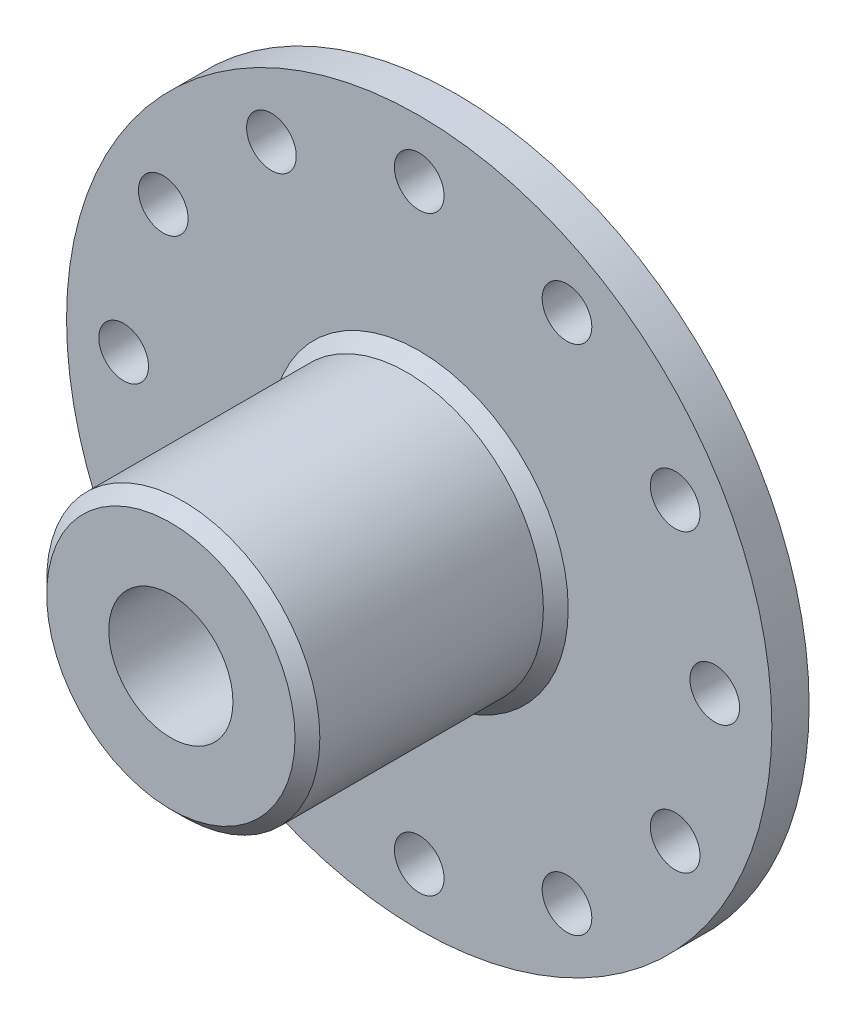
ISO-10303-21;
HEADER;
FILE_DESCRIPTION(('STEP AP214'),'2;1');
FILE_NAME('part.step','',(''),(''),'','','');
FILE_SCHEMA(('AUTOMOTIVE_DESIGN { 1 0 10303 214 1 1 1 1 }'));
ENDSEC;
DATA;
#1=APPLICATION_CONTEXT('core data for automotive mechanical design processes');
#2=APPLICATION_PROTOCOL_DEFINITION('international standard','automotive_design',2000,#1);
#3=PRODUCT_CONTEXT('',#1,'mechanical');
#4=PRODUCT('Part','Part','',(#3));
#5=PRODUCT_RELATED_PRODUCT_CATEGORY('part','',(#4));
#6=PRODUCT_DEFINITION_FORMATION('','',#4);
#7=PRODUCT_DEFINITION_CONTEXT('part definition',#1,'design');
#8=PRODUCT_DEFINITION('design','',#6,#7);
#9=PRODUCT_DEFINITION_SHAPE('','',#8);
#10=(LENGTH_UNIT() NAMED_UNIT(*) SI_UNIT(.MILLI.,.METRE.));
#11=(NAMED_UNIT(*) PLANE_ANGLE_UNIT() SI_UNIT($,.RADIAN.));
#12=(NAMED_UNIT(*) SI_UNIT($,.STERADIAN.) SOLID_ANGLE_UNIT());
#13=UNCERTAINTY_MEASURE_WITH_UNIT(LENGTH_MEASURE(1.E-05),#10,'distance_accuracy_value','');
#14=(GEOMETRIC_REPRESENTATION_CONTEXT(3) GLOBAL_UNCERTAINTY_ASSIGNED_CONTEXT((#13)) GLOBAL_UNIT_ASSIGNED_CONTEXT((#10,
#11,#12)) REPRESENTATION_CONTEXT('',''));
#15=CARTESIAN_POINT('',(0.,0.,0.));
#16=DIRECTION('',(0.,0.,1.));
#17=DIRECTION('',(1.,0.,0.));
#18=AXIS2_PLACEMENT_3D('',#15,#16,#17);
#19=CARTESIAN_POINT('',(0.,0.,3.));
#20=DIRECTION('',(0.,0.,-1.));
#21=DIRECTION('',(-1.,0.,0.));
#22=AXIS2_PLACEMENT_3D('',#19,#20,#21);
#23=CYLINDRICAL_SURFACE('',#22,28.4);
#24=CARTESIAN_POINT('',(0.,0.,3.));
#25=DIRECTION('',(0.,0.,1.));
#26=DIRECTION('',(1.,0.,0.));
#27=AXIS2_PLACEMENT_3D('',#24,#25,#26);
#28=CIRCLE('',#27,28.4);
#29=CARTESIAN_POINT('',(28.4,0.,3.));
#30=VERTEX_POINT('',#29);
#31=EDGE_CURVE('E54',#30,#30,#28,.T.);
#32=ORIENTED_EDGE('',*,*,#31,.F.);
#33=EDGE_LOOP('',(#32));
#34=FACE_BOUND('',#33,.T.);
#35=CARTESIAN_POINT('',(0.,0.,0.));
#36=DIRECTION('',(0.,0.,1.));
#37=DIRECTION('',(1.,0.,0.));
#38=AXIS2_PLACEMENT_3D('',#35,#36,#37);
#39=CIRCLE('',#38,28.4);
#40=CARTESIAN_POINT('',(28.4,0.,0.));
#41=VERTEX_POINT('',#40);
#42=EDGE_CURVE('E65',#41,#41,#39,.T.);
#43=ORIENTED_EDGE('',*,*,#42,.T.);
#44=EDGE_LOOP('',(#43));
#45=FACE_BOUND('',#44,.T.);
#46=ADVANCED_FACE('F34',(#34,#45),#23,.T.);
#47=CARTESIAN_POINT('',(0.,0.,3.));
#48=DIRECTION('',(0.,0.,1.));
#49=DIRECTION('',(1.,0.,0.));
#50=AXIS2_PLACEMENT_3D('',#47,#48,#49);
#51=PLANE('',#50);
#52=CARTESIAN_POINT('',(-11.8999999999999,20.6114046100697,3.));
#53=DIRECTION('',(0.,0.,1.));
#54=DIRECTION('',(0.499999999999998,0.86602540378444,0.));
#55=AXIS2_PLACEMENT_3D('',#52,#53,#54);
#56=CIRCLE('',#55,2.00000000000002);
#57=CARTESIAN_POINT('',(-10.8999999999999,22.3434554176386,3.));
#58=VERTEX_POINT('',#57);
#59=EDGE_CURVE('E202',#58,#58,#56,.T.);
#60=ORIENTED_EDGE('',*,*,#59,.F.);
#61=EDGE_LOOP('',(#60));
#62=FACE_BOUND('',#61,.T.);
#63=CARTESIAN_POINT('',(-20.6114046100696,11.9000000000001,3.));
#64=DIRECTION('',(0.,0.,1.));
#65=DIRECTION('',(0.,1.,0.));
#66=AXIS2_PLACEMENT_3D('',#63,#64,#65);
#67=CIRCLE('',#66,2.00000000000002);
#68=CARTESIAN_POINT('',(-20.6114046100696,13.9000000000001,3.));
#69=VERTEX_POINT('',#68);
#70=EDGE_CURVE('E196',#69,#69,#67,.T.);
#71=ORIENTED_EDGE('',*,*,#70,.F.);
#72=EDGE_LOOP('',(#71));
#73=FACE_BOUND('',#72,.T.);
#74=CARTESIAN_POINT('',(-23.8,0.,3.));
#75=DIRECTION('',(0.,0.,1.));
#76=DIRECTION('',(-0.500000000000004,0.866025403784436,0.));
#77=AXIS2_PLACEMENT_3D('',#74,#75,#76);
#78=CIRCLE('',#77,2.00000000000002);
#79=CARTESIAN_POINT('',(-24.8,1.73205080756898,3.));
#80=VERTEX_POINT('',#79);
#81=EDGE_CURVE('E190',#80,#80,#78,.T.);
#82=ORIENTED_EDGE('',*,*,#81,.F.);
#83=EDGE_LOOP('',(#82));
#84=FACE_BOUND('',#83,.T.);
#85=CARTESIAN_POINT('',(-20.6114046100697,-11.8999999999999,3.));
#86=DIRECTION('',(0.,0.,1.));
#87=DIRECTION('',(-0.866025403784442,0.499999999999995,0.));
#88=AXIS2_PLACEMENT_3D('',#85,#86,#87);
#89=CIRCLE('',#88,2.00000000000002);
#90=CARTESIAN_POINT('',(-22.3434554176386,-10.8999999999999,3.));
#91=VERTEX_POINT('',#90);
#92=EDGE_CURVE('E184',#91,#91,#89,.T.);
#93=ORIENTED_EDGE('',*,*,#92,.F.);
#94=EDGE_LOOP('',(#93));
#95=FACE_BOUND('',#94,.T.);
#96=CARTESIAN_POINT('',(-11.9000000000002,-20.6114046100695,3.));
#97=DIRECTION('',(0.,0.,1.));
#98=DIRECTION('',(-1.,0.,0.));
#99=AXIS2_PLACEMENT_3D('',#96,#97,#98);
#100=CIRCLE('',#99,2.00000000000002);
#101=CARTESIAN_POINT('',(-13.9000000000002,-20.6114046100695,3.));
#102=VERTEX_POINT('',#101);
#103=EDGE_CURVE('E178',#102,#102,#100,.T.);
#104=ORIENTED_EDGE('',*,*,#103,.F.);
#105=EDGE_LOOP('',(#104));
#106=FACE_BOUND('',#105,.T.);
#107=CARTESIAN_POINT('',(0.,-23.8,3.));
#108=DIRECTION('',(0.,0.,1.));
#109=DIRECTION('',(-0.866025403784435,-0.500000000000007,0.));
#110=AXIS2_PLACEMENT_3D('',#107,#108,#109);
#111=CIRCLE('',#110,2.00000000000002);
#112=CARTESIAN_POINT('',(-1.73205080756889,-24.8,3.));
#113=VERTEX_POINT('',#112);
#114=EDGE_CURVE('E172',#113,#113,#111,.T.);
#115=ORIENTED_EDGE('',*,*,#114,.F.);
#116=EDGE_LOOP('',(#115));
#117=FACE_BOUND('',#116,.T.);
#118=CARTESIAN_POINT('',(11.9,-20.6114046100696,3.));
#119=DIRECTION('',(0.,0.,1.));
#120=DIRECTION('',(-0.499999999999992,-0.866025403784443,0.));
#121=AXIS2_PLACEMENT_3D('',#118,#119,#120);
#122=CIRCLE('',#121,2.00000000000002);
#123=CARTESIAN_POINT('',(10.9,-22.3434554176385,3.));
#124=VERTEX_POINT('',#123);
#125=EDGE_CURVE('E166',#124,#124,#122,.T.);
#126=ORIENTED_EDGE('',*,*,#125,.F.);
#127=EDGE_LOOP('',(#126));
#128=FACE_BOUND('',#127,.T.);
#129=CARTESIAN_POINT('',(20.6114046100697,-11.9,3.));
#130=DIRECTION('',(0.,0.,1.));
#131=DIRECTION('',(0.,-1.,0.));
#132=AXIS2_PLACEMENT_3D('',#129,#130,#131);
#133=CIRCLE('',#132,2.00000000000002);
#134=CARTESIAN_POINT('',(20.6114046100697,-13.9,3.));
#135=VERTEX_POINT('',#134);
#136=EDGE_CURVE('E160',#135,#135,#133,.T.);
#137=ORIENTED_EDGE('',*,*,#136,.F.);
#138=EDGE_LOOP('',(#137));
#139=FACE_BOUND('',#138,.T.);
#140=CARTESIAN_POINT('',(23.8,0.,3.));
#141=DIRECTION('',(0.,0.,1.));
#142=DIRECTION('',(0.50000000000001,-0.866025403784433,0.));
#143=AXIS2_PLACEMENT_3D('',#140,#141,#142);
#144=CIRCLE('',#143,2.00000000000002);
#145=CARTESIAN_POINT('',(24.8,-1.7320508075688,3.));
#146=VERTEX_POINT('',#145);
#147=EDGE_CURVE('E154',#146,#146,#144,.T.);
#148=ORIENTED_EDGE('',*,*,#147,.F.);
#149=EDGE_LOOP('',(#148));
#150=FACE_BOUND('',#149,.T.);
#151=CARTESIAN_POINT('',(20.6114046100696,11.9000000000001,3.));
#152=DIRECTION('',(0.,0.,1.));
#153=DIRECTION('',(0.866025403784445,-0.499999999999989,0.));
#154=AXIS2_PLACEMENT_3D('',#151,#152,#153);
#155=CIRCLE('',#154,2.00000000000002);
#156=CARTESIAN_POINT('',(22.3434554176385,10.9000000000001,3.));
#157=VERTEX_POINT('',#156);
#158=EDGE_CURVE('E148',#157,#157,#155,.T.);
#159=ORIENTED_EDGE('',*,*,#158,.F.);
#160=EDGE_LOOP('',(#159));
#161=FACE_BOUND('',#160,.T.);
#162=CARTESIAN_POINT('',(1.73472347597681E-13,23.8,3.));
#163=DIRECTION('',(0.,0.,1.));
#164=DIRECTION('',(0.866025403784438,0.500000000000001,0.));
#165=AXIS2_PLACEMENT_3D('',#162,#163,#164);
#166=CIRCLE('',#165,2.00000000000002);
#167=CARTESIAN_POINT('',(1.73205080756906,24.8,3.));
#168=VERTEX_POINT('',#167);
#169=EDGE_CURVE('E140',#168,#168,#166,.T.);
#170=ORIENTED_EDGE('',*,*,#169,.F.);
#171=EDGE_LOOP('',(#170));
#172=FACE_BOUND('',#171,.T.);
#173=CARTESIAN_POINT('',(11.9000000000002,20.6114046100695,3.));
#174=DIRECTION('',(0.,0.,1.));
#175=DIRECTION('',(1.,0.,0.));
#176=AXIS2_PLACEMENT_3D('',#173,#174,#175);
#177=CIRCLE('',#176,2.00000000000002);
#178=CARTESIAN_POINT('',(13.9000000000002,20.6114046100695,3.));
#179=VERTEX_POINT('',#178);
#180=EDGE_CURVE('E88',#179,#179,#177,.T.);
#181=ORIENTED_EDGE('',*,*,#180,.F.);
#182=EDGE_LOOP('',(#181));
#183=FACE_BOUND('',#182,.T.);
#184=CARTESIAN_POINT('',(0.,0.,3.));
#185=DIRECTION('',(0.,0.,1.));
#186=DIRECTION('',(1.,0.,0.));
#187=AXIS2_PLACEMENT_3D('',#184,#185,#186);
#188=CIRCLE('',#187,12.);
#189=CARTESIAN_POINT('',(12.,0.,3.));
#190=VERTEX_POINT('',#189);
#191=EDGE_CURVE('E41',#190,#190,#188,.F.);
#192=ORIENTED_EDGE('',*,*,#191,.T.);
#193=EDGE_LOOP('',(#192));
#194=FACE_BOUND('',#193,.T.);
#195=ORIENTED_EDGE('',*,*,#31,.T.);
#196=EDGE_LOOP('',(#195));
#197=FACE_BOUND('',#196,.T.);
#198=ADVANCED_FACE('F99',(#62,#73,#84,#95,#106,#117,#128,#139,#150,#161,#172,#183,#194,#197),
#51,.T.);
#199=CARTESIAN_POINT('',(0.,0.,0.));
#200=DIRECTION('',(0.,0.,1.));
#201=DIRECTION('',(1.,0.,0.));
#202=AXIS2_PLACEMENT_3D('',#199,#200,#201);
#203=PLANE('',#202);
#204=CARTESIAN_POINT('',(-11.8999999999999,20.6114046100697,0.));
#205=DIRECTION('',(0.,0.,1.));
#206=DIRECTION('',(0.499999999999998,0.86602540378444,0.));
#207=AXIS2_PLACEMENT_3D('',#204,#205,#206);
#208=CIRCLE('',#207,2.00000000000002);
#209=CARTESIAN_POINT('',(-10.8999999999999,22.3434554176386,0.));
#210=VERTEX_POINT('',#209);
#211=EDGE_CURVE('E145',#210,#210,#208,.T.);
#212=ORIENTED_EDGE('',*,*,#211,.T.);
#213=EDGE_LOOP('',(#212));
#214=FACE_BOUND('',#213,.T.);
#215=CARTESIAN_POINT('',(-20.6114046100696,11.9000000000001,0.));
#216=DIRECTION('',(0.,0.,1.));
#217=DIRECTION('',(0.,1.,0.));
#218=AXIS2_PLACEMENT_3D('',#215,#216,#217);
#219=CIRCLE('',#218,2.00000000000002);
#220=CARTESIAN_POINT('',(-20.6114046100696,13.9000000000001,0.));
#221=VERTEX_POINT('',#220);
#222=EDGE_CURVE('E199',#221,#221,#219,.T.);
#223=ORIENTED_EDGE('',*,*,#222,.T.);
#224=EDGE_LOOP('',(#223));
#225=FACE_BOUND('',#224,.T.);
#226=CARTESIAN_POINT('',(-23.8,0.,0.));
#227=DIRECTION('',(0.,0.,1.));
#228=DIRECTION('',(-0.500000000000004,0.866025403784436,0.));
#229=AXIS2_PLACEMENT_3D('',#226,#227,#228);
#230=CIRCLE('',#229,2.00000000000002);
#231=CARTESIAN_POINT('',(-24.8,1.73205080756898,0.));
#232=VERTEX_POINT('',#231);
#233=EDGE_CURVE('E193',#232,#232,#230,.T.);
#234=ORIENTED_EDGE('',*,*,#233,.T.);
#235=EDGE_LOOP('',(#234));
#236=FACE_BOUND('',#235,.T.);
#237=CARTESIAN_POINT('',(-20.6114046100697,-11.8999999999999,0.));
#238=DIRECTION('',(0.,0.,1.));
#239=DIRECTION('',(-0.866025403784442,0.499999999999995,0.));
#240=AXIS2_PLACEMENT_3D('',#237,#238,#239);
#241=CIRCLE('',#240,2.00000000000002);
#242=CARTESIAN_POINT('',(-22.3434554176386,-10.8999999999999,0.));
#243=VERTEX_POINT('',#242);
#244=EDGE_CURVE('E187',#243,#243,#241,.T.);
#245=ORIENTED_EDGE('',*,*,#244,.T.);
#246=EDGE_LOOP('',(#245));
#247=FACE_BOUND('',#246,.T.);
#248=CARTESIAN_POINT('',(-11.9000000000002,-20.6114046100695,0.));
#249=DIRECTION('',(0.,0.,1.));
#250=DIRECTION('',(-1.,0.,0.));
#251=AXIS2_PLACEMENT_3D('',#248,#249,#250);
#252=CIRCLE('',#251,2.00000000000002);
#253=CARTESIAN_POINT('',(-13.9000000000002,-20.6114046100695,0.));
#254=VERTEX_POINT('',#253);
#255=EDGE_CURVE('E181',#254,#254,#252,.T.);
#256=ORIENTED_EDGE('',*,*,#255,.T.);
#257=EDGE_LOOP('',(#256));
#258=FACE_BOUND('',#257,.T.);
#259=CARTESIAN_POINT('',(0.,-23.8,0.));
#260=DIRECTION('',(0.,0.,1.));
#261=DIRECTION('',(-0.866025403784435,-0.500000000000007,0.));
#262=AXIS2_PLACEMENT_3D('',#259,#260,#261);
#263=CIRCLE('',#262,2.00000000000002);
#264=CARTESIAN_POINT('',(-1.73205080756889,-24.8,0.));
#265=VERTEX_POINT('',#264);
#266=EDGE_CURVE('E175',#265,#265,#263,.T.);
#267=ORIENTED_EDGE('',*,*,#266,.T.);
#268=EDGE_LOOP('',(#267));
#269=FACE_BOUND('',#268,.T.);
#270=CARTESIAN_POINT('',(11.9,-20.6114046100696,0.));
#271=DIRECTION('',(0.,0.,1.));
#272=DIRECTION('',(-0.499999999999992,-0.866025403784443,0.));
#273=AXIS2_PLACEMENT_3D('',#270,#271,#272);
#274=CIRCLE('',#273,2.00000000000002);
#275=CARTESIAN_POINT('',(10.9,-22.3434554176385,0.));
#276=VERTEX_POINT('',#275);
#277=EDGE_CURVE('E169',#276,#276,#274,.T.);
#278=ORIENTED_EDGE('',*,*,#277,.T.);
#279=EDGE_LOOP('',(#278));
#280=FACE_BOUND('',#279,.T.);
#281=CARTESIAN_POINT('',(20.6114046100697,-11.9,0.));
#282=DIRECTION('',(0.,0.,1.));
#283=DIRECTION('',(0.,-1.,0.));
#284=AXIS2_PLACEMENT_3D('',#281,#282,#283);
#285=CIRCLE('',#284,2.00000000000002);
#286=CARTESIAN_POINT('',(20.6114046100697,-13.9,0.));
#287=VERTEX_POINT('',#286);
#288=EDGE_CURVE('E163',#287,#287,#285,.T.);
#289=ORIENTED_EDGE('',*,*,#288,.T.);
#290=EDGE_LOOP('',(#289));
#291=FACE_BOUND('',#290,.T.);
#292=CARTESIAN_POINT('',(23.8,0.,0.));
#293=DIRECTION('',(0.,0.,1.));
#294=DIRECTION('',(0.50000000000001,-0.866025403784433,0.));
#295=AXIS2_PLACEMENT_3D('',#292,#293,#294);
#296=CIRCLE('',#295,2.00000000000002);
#297=CARTESIAN_POINT('',(24.8,-1.7320508075688,0.));
#298=VERTEX_POINT('',#297);
#299=EDGE_CURVE('E157',#298,#298,#296,.T.);
#300=ORIENTED_EDGE('',*,*,#299,.T.);
#301=EDGE_LOOP('',(#300));
#302=FACE_BOUND('',#301,.T.);
#303=CARTESIAN_POINT('',(20.6114046100696,11.9000000000001,0.));
#304=DIRECTION('',(0.,0.,1.));
#305=DIRECTION('',(0.866025403784445,-0.499999999999989,0.));
#306=AXIS2_PLACEMENT_3D('',#303,#304,#305);
#307=CIRCLE('',#306,2.00000000000002);
#308=CARTESIAN_POINT('',(22.3434554176385,10.9000000000001,0.));
#309=VERTEX_POINT('',#308);
#310=EDGE_CURVE('E151',#309,#309,#307,.T.);
#311=ORIENTED_EDGE('',*,*,#310,.T.);
#312=EDGE_LOOP('',(#311));
#313=FACE_BOUND('',#312,.T.);
#314=CARTESIAN_POINT('',(1.73472347597681E-13,23.8,0.));
#315=DIRECTION('',(0.,0.,1.));
#316=DIRECTION('',(0.866025403784438,0.500000000000001,0.));
#317=AXIS2_PLACEMENT_3D('',#314,#315,#316);
#318=CIRCLE('',#317,2.00000000000002);
#319=CARTESIAN_POINT('',(1.73205080756906,24.8,0.));
#320=VERTEX_POINT('',#319);
#321=EDGE_CURVE('E138',#320,#320,#318,.T.);
#322=ORIENTED_EDGE('',*,*,#321,.T.);
#323=EDGE_LOOP('',(#322));
#324=FACE_BOUND('',#323,.T.);
#325=CARTESIAN_POINT('',(11.9000000000002,20.6114046100695,0.));
#326=DIRECTION('',(0.,0.,1.));
#327=DIRECTION('',(1.,0.,0.));
#328=AXIS2_PLACEMENT_3D('',#325,#326,#327);
#329=CIRCLE('',#328,2.00000000000002);
#330=CARTESIAN_POINT('',(13.9000000000002,20.6114046100695,0.));
#331=VERTEX_POINT('',#330);
#332=EDGE_CURVE('E64',#331,#331,#329,.T.);
#333=ORIENTED_EDGE('',*,*,#332,.T.);
#334=EDGE_LOOP('',(#333));
#335=FACE_BOUND('',#334,.T.);
#336=CARTESIAN_POINT('',(0.,0.,0.));
#337=DIRECTION('',(0.,0.,1.));
#338=DIRECTION('',(1.,0.,0.));
#339=AXIS2_PLACEMENT_3D('',#336,#337,#338);
#340=CIRCLE('',#339,5.);
#341=CARTESIAN_POINT('',(5.,0.,0.));
#342=VERTEX_POINT('',#341);
#343=EDGE_CURVE('E90',#342,#342,#340,.T.);
#344=ORIENTED_EDGE('',*,*,#343,.T.);
#345=EDGE_LOOP('',(#344));
#346=FACE_BOUND('',#345,.T.);
#347=ORIENTED_EDGE('',*,*,#42,.F.);
#348=EDGE_LOOP('',(#347));
#349=FACE_BOUND('',#348,.T.);
#350=ADVANCED_FACE('F97',(#214,#225,#236,#247,#258,#269,#280,#291,#302,#313,#324,#335,#346,
#349),#203,.F.);
#351=CARTESIAN_POINT('',(0.,0.,23.));
#352=DIRECTION('',(0.,0.,-1.));
#353=DIRECTION('',(-1.,0.,0.));
#354=AXIS2_PLACEMENT_3D('',#351,#352,#353);
#355=CYLINDRICAL_SURFACE('',#354,11.);
#356=CARTESIAN_POINT('',(0.,0.,4.00000000000001));
#357=DIRECTION('',(0.,0.,1.));
#358=DIRECTION('',(1.,0.,0.));
#359=AXIS2_PLACEMENT_3D('',#356,#357,#358);
#360=CIRCLE('',#359,11.);
#361=CARTESIAN_POINT('',(11.,0.,4.00000000000001));
#362=VERTEX_POINT('',#361);
#363=EDGE_CURVE('E45',#362,#362,#360,.T.);
#364=ORIENTED_EDGE('',*,*,#363,.T.);
#365=EDGE_LOOP('',(#364));
#366=FACE_BOUND('',#365,.T.);
#367=CARTESIAN_POINT('',(0.,0.,22.));
#368=DIRECTION('',(0.,0.,1.));
#369=DIRECTION('',(1.,0.,0.));
#370=AXIS2_PLACEMENT_3D('',#367,#368,#369);
#371=CIRCLE('',#370,11.);
#372=CARTESIAN_POINT('',(11.,0.,22.));
#373=VERTEX_POINT('',#372);
#374=EDGE_CURVE('E49',#373,#373,#371,.F.);
#375=ORIENTED_EDGE('',*,*,#374,.T.);
#376=EDGE_LOOP('',(#375));
#377=FACE_BOUND('',#376,.T.);
#378=CARTESIAN_POINT('',(0.,-11.,17.));
#379=CARTESIAN_POINT('',(0.111357271644373,-10.9999980072786,16.9999956813393));
#380=CARTESIAN_POINT('',(0.222771449918202,-10.9982915273343,16.9906682425174));
#381=CARTESIAN_POINT('',(0.442464406848309,-10.99164847502,16.9536265339751));
#382=CARTESIAN_POINT('',(0.550740387266074,-10.9867091072254,16.9258963514186));
#383=CARTESIAN_POINT('',(0.760947572513749,-10.9741532323507,16.852922870329));
#384=CARTESIAN_POINT('',(0.862884263930179,-10.9665390793192,16.8076949678102));
#385=CARTESIAN_POINT('',(1.0577120033845,-10.949466714983,16.7010526688082));
#386=CARTESIAN_POINT('',(1.15060386767905,-10.9400086703132,16.6396397348118));
#387=CARTESIAN_POINT('',(1.32576444051239,-10.9201743349983,16.5016340903573));
#388=CARTESIAN_POINT('',(1.40791622603346,-10.9097897259708,16.4248941580192));
#389=CARTESIAN_POINT('',(1.55825357341079,-10.8893349521181,16.2587296459102));
#390=CARTESIAN_POINT('',(1.62643816794977,-10.8792648091126,16.1693041883108));
#391=CARTESIAN_POINT('',(1.74738695016477,-10.8604984020977,15.9794872705402));
#392=CARTESIAN_POINT('',(1.80003313265556,-10.851812871101,15.8790194647696));
#393=CARTESIAN_POINT('',(1.88765546949978,-10.836915832769,15.670481349676));
#394=CARTESIAN_POINT('',(1.92263305283275,-10.8307041253674,15.562411655975));
#395=CARTESIAN_POINT('',(1.97355197711315,-10.8215415351671,15.3429853506434));
#396=CARTESIAN_POINT('',(1.98969666425445,-10.8185558462234,15.2316774082904));
#397=CARTESIAN_POINT('',(2.00312248736688,-10.8160783143231,15.0078955926854));
#398=CARTESIAN_POINT('',(2.00040521296643,-10.8165861769405,14.895421818484));
#399=CARTESIAN_POINT('',(1.97634934427,-10.8210066504918,14.673968085867));
#400=CARTESIAN_POINT('',(1.95524117699072,-10.8248771281426,14.5649621321043));
#401=CARTESIAN_POINT('',(1.89536523340026,-10.8355206127391,14.3520649816328));
#402=CARTESIAN_POINT('',(1.85659674743188,-10.8422937363232,14.2481739906482));
#403=CARTESIAN_POINT('',(1.76227297789295,-10.8580238155272,14.0477772092213));
#404=CARTESIAN_POINT('',(1.7066239037154,-10.8669929171435,13.9513165573339));
#405=CARTESIAN_POINT('',(1.58018503374043,-10.8860962201172,13.7690152630547));
#406=CARTESIAN_POINT('',(1.50939379023584,-10.8962305328347,13.6831756373538));
#407=CARTESIAN_POINT('',(1.35343399418352,-10.9167064080854,13.5232210035556));
#408=CARTESIAN_POINT('',(1.2680681726569,-10.9270488181647,13.4492983115631));
#409=CARTESIAN_POINT('',(1.08604454069331,-10.9466375043709,13.3167948665192));
#410=CARTESIAN_POINT('',(0.989386629498157,-10.9558837707156,13.2582142503787));
#411=CARTESIAN_POINT('',(0.787327598497296,-10.9722553782534,13.158032610215));
#412=CARTESIAN_POINT('',(0.681916780395491,-10.9793783255922,13.116450731304));
#413=CARTESIAN_POINT('',(0.465448414462665,-10.9906820547088,13.0516368075063));
#414=CARTESIAN_POINT('',(0.354391431316063,-10.994863130091,13.0284029314261));
#415=CARTESIAN_POINT('',(0.131438649578498,-10.9997719337866,13.0012102380809));
#416=CARTESIAN_POINT('',(0.019576012108933,-11.0005468934114,12.9969877765459));
#417=CARTESIAN_POINT('',(-0.203257238970968,-10.998686302475,13.0072317981815));
#418=CARTESIAN_POINT('',(-0.314227893453083,-10.9960509090871,13.0216974200717));
#419=CARTESIAN_POINT('',(-0.531297097592759,-10.9876950863245,13.0686877495619));
#420=CARTESIAN_POINT('',(-0.637425297458318,-10.9819973157216,13.1010798691828));
#421=CARTESIAN_POINT('',(-0.842744713756611,-10.9681529512222,13.1828608285219));
#422=CARTESIAN_POINT('',(-0.94193548096095,-10.9600061989244,13.2322507676977));
#423=CARTESIAN_POINT('',(-1.13169524707494,-10.9420497958484,13.3472146378029));
#424=CARTESIAN_POINT('',(-1.22216445208488,-10.932223816146,13.4129506871559));
#425=CARTESIAN_POINT('',(-1.39088213822347,-10.9120428807109,13.5585203766711));
#426=CARTESIAN_POINT('',(-1.46912954974332,-10.901687878785,13.6383552494119));
#427=CARTESIAN_POINT('',(-1.6121773788768,-10.8814603955764,13.8110468814485));
#428=CARTESIAN_POINT('',(-1.67679836741418,-10.8715955212189,13.9040533065259));
#429=CARTESIAN_POINT('',(-1.78949986552014,-10.8536151008102,14.0997561814065));
#430=CARTESIAN_POINT('',(-1.83758096630795,-10.8454994922354,14.2024522846844));
#431=CARTESIAN_POINT('',(-1.91557945241746,-10.8319954461548,14.4141507496917));
#432=CARTESIAN_POINT('',(-1.9455810786184,-10.8265943801675,14.5231212307381));
#433=CARTESIAN_POINT('',(-1.98683040178554,-10.8191012654539,14.7446629886311));
#434=CARTESIAN_POINT('',(-1.99808007453629,-10.8170088681136,14.8572338848489));
#435=CARTESIAN_POINT('',(-2.00144313663184,-10.8163869388262,15.0809853754636));
#436=CARTESIAN_POINT('',(-1.99383937001232,-10.8178047454411,15.1921616714385));
#437=CARTESIAN_POINT('',(-1.96032846912815,-10.8239270874703,15.4116236380174));
#438=CARTESIAN_POINT('',(-1.93442142905718,-10.8286316059701,15.5199093234943));
#439=CARTESIAN_POINT('',(-1.86515567158476,-10.8407757208091,15.7303761973954));
#440=CARTESIAN_POINT('',(-1.82182581019232,-10.8482107929975,15.8325671602234));
#441=CARTESIAN_POINT('',(-1.71897473664823,-10.8649817751485,16.0282744471647));
#442=CARTESIAN_POINT('',(-1.65945247569007,-10.8743178082294,16.1217902088456));
#443=CARTESIAN_POINT('',(-1.52491543662799,-10.8940032465147,16.2989128745956));
#444=CARTESIAN_POINT('',(-1.44969415553099,-10.9043650783111,16.3823615698708));
#445=CARTESIAN_POINT('',(-1.28632651423364,-10.9248399206865,16.5355470810122));
#446=CARTESIAN_POINT('',(-1.19817718680093,-10.9349528735191,16.6052807403922));
#447=CARTESIAN_POINT('',(-1.0105711896463,-10.9538897429719,16.7296002971235));
#448=CARTESIAN_POINT('',(-0.911025849790496,-10.9627021317343,16.7840541851801));
#449=CARTESIAN_POINT('',(-0.704073905086345,-10.9779326099335,16.8753792160741));
#450=CARTESIAN_POINT('',(-0.596674925486671,-10.9843529858473,16.9122671592783));
#451=CARTESIAN_POINT('',(-0.407441749458407,-10.9927407037649,16.9597754303022));
#452=CARTESIAN_POINT('',(-0.326725427276491,-10.9954478027358,16.9748343329604));
#453=CARTESIAN_POINT('',(-0.164016342132203,-10.9990781643304,16.9949480937949));
#454=CARTESIAN_POINT('',(-0.0820236084408332,-11.0000014678,17.0000031810418));
#455=CARTESIAN_POINT('',(0.,-11.,17.));
#456=B_SPLINE_CURVE_WITH_KNOTS('',3,(#378,#379,#380,#381,#382,#383,#384,#385,#386,#387,#388,
#389,#390,#391,#392,#393,#394,#395,#396,#397,#398,#399,#400,#401,#402,#403,#404,#405,#406,#407,
#408,#409,#410,#411,#412,#413,#414,#415,#416,#417,#418,#419,#420,#421,#422,#423,#424,#425,#426,
#427,#428,#429,#430,#431,#432,#433,#434,#435,#436,#437,#438,#439,#440,#441,#442,#443,#444,#445,
#446,#447,#448,#449,#450,#451,#452,#453,#454,#455),.UNSPECIFIED.,.T.,.F.,(4,2,2,2,2,2,2,2,2,2,2,
2,2,2,2,2,2,2,2,2,2,2,2,2,2,2,2,2,2,2,2,2,2,2,2,2,2,2,4),(0.,0.333771891552332,
0.667832772072591,1.00160038286675,1.3353378446015,1.67245014596885,2.00958578663079,
2.3492195220365,2.6888257845573,3.02473021172645,3.36060633024203,3.69233367290895,
4.02407434678871,4.35769306461625,4.69134369321255,5.02993210441872,5.36852353704646,
5.70749527023812,6.04643316861453,6.38065600997364,6.71486344850797,7.0466314328543,
7.37842088074221,7.71364226795666,8.04889297616123,8.38831506130458,8.72772501252474,
9.06554101076157,9.40332141303601,9.73606509730371,10.0688070691931,10.4010002025896,
10.733214857769,11.0701111453004,11.4070848782946,11.7468860454293,12.0863615649817,
12.3322171022956,12.5780670098676),.UNSPECIFIED.);
#457=CARTESIAN_POINT('',(0.,-11.,17.));
#458=VERTEX_POINT('',#457);
#459=EDGE_CURVE('E63',#458,#458,#456,.T.);
#460=ORIENTED_EDGE('',*,*,#459,.T.);
#461=EDGE_LOOP('',(#460));
#462=FACE_BOUND('',#461,.T.);
#463=ADVANCED_FACE('F92',(#366,#377,#462),#355,.T.);
#464=CARTESIAN_POINT('',(0.,0.,23.));
#465=DIRECTION('',(0.,0.,1.));
#466=DIRECTION('',(1.,0.,0.));
#467=AXIS2_PLACEMENT_3D('',#464,#465,#466);
#468=PLANE('',#467);
#469=CARTESIAN_POINT('',(0.,0.,23.));
#470=DIRECTION('',(0.,0.,1.));
#471=DIRECTION('',(1.,0.,0.));
#472=AXIS2_PLACEMENT_3D('',#469,#470,#471);
#473=CIRCLE('',#472,10.);
#474=CARTESIAN_POINT('',(10.,0.,23.));
#475=VERTEX_POINT('',#474);
#476=EDGE_CURVE('E10',#475,#475,#473,.T.);
#477=ORIENTED_EDGE('',*,*,#476,.T.);
#478=EDGE_LOOP('',(#477));
#479=FACE_BOUND('',#478,.T.);
#480=CARTESIAN_POINT('',(0.,0.,23.));
#481=DIRECTION('',(0.,0.,1.));
#482=DIRECTION('',(1.,0.,0.));
#483=AXIS2_PLACEMENT_3D('',#480,#481,#482);
#484=CIRCLE('',#483,5.);
#485=CARTESIAN_POINT('',(5.,0.,23.));
#486=VERTEX_POINT('',#485);
#487=EDGE_CURVE('E87',#486,#486,#484,.T.);
#488=ORIENTED_EDGE('',*,*,#487,.F.);
#489=EDGE_LOOP('',(#488));
#490=FACE_BOUND('',#489,.T.);
#491=ADVANCED_FACE('F96',(#479,#490),#468,.T.);
#492=CARTESIAN_POINT('',(0.,0.,0.));
#493=DIRECTION('',(0.,0.,1.));
#494=DIRECTION('',(1.,0.,0.));
#495=AXIS2_PLACEMENT_3D('',#492,#493,#494);
#496=CYLINDRICAL_SURFACE('',#495,5.);
#497=CARTESIAN_POINT('',(0.,-5.,17.));
#498=CARTESIAN_POINT('',(-0.107493005442891,-4.99999271227085,16.9999901481763));
#499=CARTESIAN_POINT('',(-0.215172564090673,-4.99649294306932,16.9912822479116));
#500=CARTESIAN_POINT('',(-0.427496480417896,-4.98283453100641,16.9567522964788));
#501=CARTESIAN_POINT('',(-0.532131777561248,-4.97265778698877,16.9308837209139));
#502=CARTESIAN_POINT('',(-0.734953922727403,-4.94674209213118,16.8631239219412));
#503=CARTESIAN_POINT('',(-0.83316066161696,-4.93102136364072,16.8212851537833));
#504=CARTESIAN_POINT('',(-1.02107197032837,-4.89556610796078,16.7229808266735));
#505=CARTESIAN_POINT('',(-1.11077947675099,-4.87583297458057,16.6665203450811));
#506=CARTESIAN_POINT('',(-1.28350100757039,-4.83330886170419,16.5377645014391));
#507=CARTESIAN_POINT('',(-1.36606227255021,-4.81042296929191,16.4648933437597));
#508=CARTESIAN_POINT('',(-1.51817500478472,-4.76460576906195,16.3065999965232));
#509=CARTESIAN_POINT('',(-1.58772010713353,-4.74167444453792,16.2211717027883));
#510=CARTESIAN_POINT('',(-1.71487456729288,-4.69722791797136,16.0355719297577));
#511=CARTESIAN_POINT('',(-1.77181498119547,-4.67582115964951,15.9349135139768));
#512=CARTESIAN_POINT('',(-1.86775471903715,-4.63833647186793,15.72446360158));
#513=CARTESIAN_POINT('',(-1.90676256428583,-4.62225601244176,15.6146764721516));
#514=CARTESIAN_POINT('',(-1.96389882339587,-4.59826357660818,15.3942876664079));
#515=CARTESIAN_POINT('',(-1.98289396580565,-4.59001420355605,15.2839487644238));
#516=CARTESIAN_POINT('',(-2.00217296164003,-4.58164004049144,15.0613650016927));
#517=CARTESIAN_POINT('',(-2.00246601631322,-4.58151125522768,14.949121105375));
#518=CARTESIAN_POINT('',(-1.98498936750454,-4.58910500279994,14.734243328542));
#519=CARTESIAN_POINT('',(-1.96847531430514,-4.5962817503845,14.631484285591));
#520=CARTESIAN_POINT('',(-1.91994688029782,-4.61676187607836,14.4303404439933));
#521=CARTESIAN_POINT('',(-1.88792979480463,-4.63006632321673,14.3319564118897));
#522=CARTESIAN_POINT('',(-1.80869473255107,-4.6615948508853,14.139982163804));
#523=CARTESIAN_POINT('',(-1.76117986231532,-4.67991379280788,14.0465307609453));
#524=CARTESIAN_POINT('',(-1.65250646073221,-4.7193811638989,13.8685841836384));
#525=CARTESIAN_POINT('',(-1.59134280510084,-4.74053065456848,13.7840923905972));
#526=CARTESIAN_POINT('',(-1.45155059945443,-4.78526736742271,13.619590271198));
#527=CARTESIAN_POINT('',(-1.37193746297063,-4.80891664976152,13.540431270554));
#528=CARTESIAN_POINT('',(-1.20031442743019,-4.85459824958282,13.396315521998));
#529=CARTESIAN_POINT('',(-1.10830206533443,-4.87663024445325,13.3313616025897));
#530=CARTESIAN_POINT('',(-0.912077652605843,-4.91714681264548,13.2163825525842));
#531=CARTESIAN_POINT('',(-0.807660491346477,-4.93555270095415,13.1666777188029));
#532=CARTESIAN_POINT('',(-0.591023765482881,-4.96614828328759,13.0858321389219));
#533=CARTESIAN_POINT('',(-0.478808196849673,-4.97834113462382,13.0546819624426));
#534=CARTESIAN_POINT('',(-0.25689588760782,-4.99456139506911,13.0135517045803));
#535=CARTESIAN_POINT('',(-0.147443293985534,-4.99902945833514,13.0024275457464));
#536=CARTESIAN_POINT('',(0.0718453098078176,-5.00068478510631,12.9982868994714));
#537=CARTESIAN_POINT('',(0.181681213223924,-4.99787393582291,13.0052657184525));
#538=CARTESIAN_POINT('',(0.393432739121988,-4.98557567063753,13.036291752552));
#539=CARTESIAN_POINT('',(0.495482491775475,-4.97639391345523,13.059557980351));
#540=CARTESIAN_POINT('',(0.694135428060781,-4.952594414055,13.1214357083098));
#541=CARTESIAN_POINT('',(0.790737910224845,-4.9379759735653,13.1600491796687));
#542=CARTESIAN_POINT('',(0.979078785816703,-4.90416594770812,13.2527849396799));
#543=CARTESIAN_POINT('',(1.07057802275541,-4.88484815979803,13.3073454720431));
#544=CARTESIAN_POINT('',(1.24344359124656,-4.84373364745525,13.4299403239056));
#545=CARTESIAN_POINT('',(1.32480584076113,-4.8219359311027,13.4979800429226));
#546=CARTESIAN_POINT('',(1.48072304302882,-4.77645117638112,13.6508700129496));
#547=CARTESIAN_POINT('',(1.55447393380607,-4.75273441425052,13.7365335415062));
#548=CARTESIAN_POINT('',(1.68675119741371,-4.70741672917132,13.9194400830094));
#549=CARTESIAN_POINT('',(1.74527506133751,-4.68581615526511,14.0166850003399));
#550=CARTESIAN_POINT('',(1.84580750193163,-4.64714299907709,14.2214616945941));
#551=CARTESIAN_POINT('',(1.88765059453445,-4.63011630884788,14.3290839992123));
#552=CARTESIAN_POINT('',(1.9522962197053,-4.60323673477932,14.5507336517152));
#553=CARTESIAN_POINT('',(1.97511280526931,-4.59337855695998,14.6647562058124));
#554=CARTESIAN_POINT('',(1.9997156172784,-4.58271759299926,14.8871279017745));
#555=CARTESIAN_POINT('',(2.00289708230287,-4.58131421008171,14.9952948395933));
#556=CARTESIAN_POINT('',(1.99180315927752,-4.58614836033098,15.2105448577133));
#557=CARTESIAN_POINT('',(1.97752998791378,-4.59238492324793,15.3176280739026));
#558=CARTESIAN_POINT('',(1.93307136615365,-4.61126649079021,15.523332189855));
#559=CARTESIAN_POINT('',(1.90353749357098,-4.62364831827449,15.622120274433));
#560=CARTESIAN_POINT('',(1.83000544849101,-4.65324001232697,15.8133786296135));
#561=CARTESIAN_POINT('',(1.78600328139381,-4.67045121206007,15.9058471468998));
#562=CARTESIAN_POINT('',(1.68187276275973,-4.70898609604491,16.0876096192708));
#563=CARTESIAN_POINT('',(1.62096533515949,-4.73048882313242,16.1764186701305));
#564=CARTESIAN_POINT('',(1.4858921192715,-4.77463804372237,16.3429933172038));
#565=CARTESIAN_POINT('',(1.41172233481812,-4.79728488048406,16.4207555721283));
#566=CARTESIAN_POINT('',(1.24650550627246,-4.84293567087394,16.5682028532636));
#567=CARTESIAN_POINT('',(1.15467600114614,-4.86586757962185,16.6370373068981));
#568=CARTESIAN_POINT('',(0.959900320285779,-4.90800406713717,16.7583370426216));
#569=CARTESIAN_POINT('',(0.856949004547238,-4.92720691092906,16.8107947121525));
#570=CARTESIAN_POINT('',(0.644738062495204,-4.95939714815861,16.8966222151903));
#571=CARTESIAN_POINT('',(0.535631618219696,-4.97249363055028,16.9303293235603));
#572=CARTESIAN_POINT('',(0.312876546281221,-4.99144306209366,16.9786391209543));
#573=CARTESIAN_POINT('',(0.199243525858913,-4.99731899495638,16.9933024367439));
#574=CARTESIAN_POINT('',(0.0569122978909302,-4.99975899504136,16.9993953809783));
#575=CARTESIAN_POINT('',(0.0284626887407586,-5.00000192969176,17.0000026086292));
#576=CARTESIAN_POINT('',(0.,-5.,17.));
#577=B_SPLINE_CURVE_WITH_KNOTS('',3,(#497,#498,#499,#500,#501,#502,#503,#504,#505,#506,#507,
#508,#509,#510,#511,#512,#513,#514,#515,#516,#517,#518,#519,#520,#521,#522,#523,#524,#525,#526,
#527,#528,#529,#530,#531,#532,#533,#534,#535,#536,#537,#538,#539,#540,#541,#542,#543,#544,#545,
#546,#547,#548,#549,#550,#551,#552,#553,#554,#555,#556,#557,#558,#559,#560,#561,#562,#563,#564,
#565,#566,#567,#568,#569,#570,#571,#572,#573,#574,#575,#576),.UNSPECIFIED.,.T.,.F.,(4,2,2,2,2,2,
2,2,2,2,2,2,2,2,2,2,2,2,2,2,2,2,2,2,2,2,2,2,2,2,2,2,2,2,2,2,2,2,2,4),(0.,0.322402987893071,
0.645683636007935,0.967911457471582,1.29002753567984,1.62597381700397,1.96208394934411,
2.31315258819217,2.66405423118268,2.99904105308829,3.33386306340488,3.64538328401372,
3.95695787256048,4.27489126298816,4.59294421938183,4.93558349186557,5.27829092839733,
5.62776913162806,5.9770695611379,6.30569184528007,6.63422893570082,6.94800455564365,
7.26182048993796,7.58523513398263,7.90877959498969,8.25368474624414,8.59864669043748,
8.94695045140827,9.29499672645934,9.61799673392748,9.94095572563046,10.2511431854877,
10.5614163580516,10.8894546805669,11.2175920134839,11.5670042353384,11.9165786364053,
12.2596430101332,12.6016125240434,12.686980458968),.UNSPECIFIED.);
#578=CARTESIAN_POINT('',(0.,-5.,17.));
#579=VERTEX_POINT('',#578);
#580=EDGE_CURVE('E55',#579,#579,#577,.T.);
#581=ORIENTED_EDGE('',*,*,#580,.T.);
#582=EDGE_LOOP('',(#581));
#583=FACE_BOUND('',#582,.T.);
#584=ORIENTED_EDGE('',*,*,#343,.F.);
#585=EDGE_LOOP('',(#584));
#586=FACE_BOUND('',#585,.T.);
#587=ORIENTED_EDGE('',*,*,#487,.T.);
#588=EDGE_LOOP('',(#587));
#589=FACE_BOUND('',#588,.T.);
#590=ADVANCED_FACE('F67',(#583,#586,#589),#496,.F.);
#591=CARTESIAN_POINT('',(0.,-15.,15.));
#592=DIRECTION('',(0.,1.,0.));
#593=DIRECTION('',(0.,0.,1.));
#594=AXIS2_PLACEMENT_3D('',#591,#592,#593);
#595=CYLINDRICAL_SURFACE('',#594,2.);
#596=ORIENTED_EDGE('',*,*,#580,.F.);
#597=EDGE_LOOP('',(#596));
#598=FACE_BOUND('',#597,.T.);
#599=ORIENTED_EDGE('',*,*,#459,.F.);
#600=EDGE_LOOP('',(#599));
#601=FACE_BOUND('',#600,.T.);
#602=ADVANCED_FACE('F70',(#598,#601),#595,.F.);
#603=CARTESIAN_POINT('',(0.,0.,4.00000000000001));
#604=DIRECTION('',(0.,0.,-1.));
#605=DIRECTION('',(-1.,0.,0.));
#606=AXIS2_PLACEMENT_3D('',#603,#604,#605);
#607=CONICAL_SURFACE('',#606,11.,0.785398163397443);
#608=ORIENTED_EDGE('',*,*,#191,.F.);
#609=EDGE_LOOP('',(#608));
#610=FACE_BOUND('',#609,.T.);
#611=ORIENTED_EDGE('',*,*,#363,.F.);
#612=EDGE_LOOP('',(#611));
#613=FACE_BOUND('',#612,.T.);
#614=ADVANCED_FACE('F74',(#610,#613),#607,.T.);
#615=CARTESIAN_POINT('',(0.,0.,23.));
#616=DIRECTION('',(0.,0.,-1.));
#617=DIRECTION('',(-1.,0.,0.));
#618=AXIS2_PLACEMENT_3D('',#615,#616,#617);
#619=CONICAL_SURFACE('',#618,10.,0.785398163397443);
#620=ORIENTED_EDGE('',*,*,#374,.F.);
#621=EDGE_LOOP('',(#620));
#622=FACE_BOUND('',#621,.T.);
#623=ORIENTED_EDGE('',*,*,#476,.F.);
#624=EDGE_LOOP('',(#623));
#625=FACE_BOUND('',#624,.T.);
#626=ADVANCED_FACE('F36',(#622,#625),#619,.T.);
#627=CARTESIAN_POINT('',(11.9000000000002,20.6114046100695,0.));
#628=DIRECTION('',(0.,0.,1.));
#629=DIRECTION('',(1.,0.,0.));
#630=AXIS2_PLACEMENT_3D('',#627,#628,#629);
#631=CYLINDRICAL_SURFACE('',#630,2.00000000000002);
#632=ORIENTED_EDGE('',*,*,#332,.F.);
#633=EDGE_LOOP('',(#632));
#634=FACE_BOUND('',#633,.T.);
#635=ORIENTED_EDGE('',*,*,#180,.T.);
#636=EDGE_LOOP('',(#635));
#637=FACE_BOUND('',#636,.T.);
#638=ADVANCED_FACE('F76',(#634,#637),#631,.F.);
#639=CARTESIAN_POINT('',(1.73472347597681E-13,23.8,0.));
#640=DIRECTION('',(0.,0.,1.));
#641=DIRECTION('',(1.,0.,0.));
#642=AXIS2_PLACEMENT_3D('',#639,#640,#641);
#643=CYLINDRICAL_SURFACE('',#642,2.00000000000002);
#644=ORIENTED_EDGE('',*,*,#321,.F.);
#645=EDGE_LOOP('',(#644));
#646=FACE_BOUND('',#645,.T.);
#647=ORIENTED_EDGE('',*,*,#169,.T.);
#648=EDGE_LOOP('',(#647));
#649=FACE_BOUND('',#648,.T.);
#650=ADVANCED_FACE('F125',(#646,#649),#643,.F.);
#651=CARTESIAN_POINT('',(20.6114046100696,11.9000000000001,0.));
#652=DIRECTION('',(0.,0.,1.));
#653=DIRECTION('',(1.,0.,0.));
#654=AXIS2_PLACEMENT_3D('',#651,#652,#653);
#655=CYLINDRICAL_SURFACE('',#654,2.00000000000002);
#656=ORIENTED_EDGE('',*,*,#310,.F.);
#657=EDGE_LOOP('',(#656));
#658=FACE_BOUND('',#657,.T.);
#659=ORIENTED_EDGE('',*,*,#158,.T.);
#660=EDGE_LOOP('',(#659));
#661=FACE_BOUND('',#660,.T.);
#662=ADVANCED_FACE('F130',(#658,#661),#655,.F.);
#663=CARTESIAN_POINT('',(23.8,0.,0.));
#664=DIRECTION('',(0.,0.,1.));
#665=DIRECTION('',(1.,0.,0.));
#666=AXIS2_PLACEMENT_3D('',#663,#664,#665);
#667=CYLINDRICAL_SURFACE('',#666,2.00000000000002);
#668=ORIENTED_EDGE('',*,*,#299,.F.);
#669=EDGE_LOOP('',(#668));
#670=FACE_BOUND('',#669,.T.);
#671=ORIENTED_EDGE('',*,*,#147,.T.);
#672=EDGE_LOOP('',(#671));
#673=FACE_BOUND('',#672,.T.);
#674=ADVANCED_FACE('F309',(#670,#673),#667,.F.);
#675=CARTESIAN_POINT('',(20.6114046100697,-11.9,0.));
#676=DIRECTION('',(0.,0.,1.));
#677=DIRECTION('',(1.,0.,0.));
#678=AXIS2_PLACEMENT_3D('',#675,#676,#677);
#679=CYLINDRICAL_SURFACE('',#678,2.00000000000002);
#680=ORIENTED_EDGE('',*,*,#288,.F.);
#681=EDGE_LOOP('',(#680));
#682=FACE_BOUND('',#681,.T.);
#683=ORIENTED_EDGE('',*,*,#136,.T.);
#684=EDGE_LOOP('',(#683));
#685=FACE_BOUND('',#684,.T.);
#686=ADVANCED_FACE('F318',(#682,#685),#679,.F.);
#687=CARTESIAN_POINT('',(11.9,-20.6114046100696,0.));
#688=DIRECTION('',(0.,0.,1.));
#689=DIRECTION('',(1.,0.,0.));
#690=AXIS2_PLACEMENT_3D('',#687,#688,#689);
#691=CYLINDRICAL_SURFACE('',#690,2.00000000000002);
#692=ORIENTED_EDGE('',*,*,#277,.F.);
#693=EDGE_LOOP('',(#692));
#694=FACE_BOUND('',#693,.T.);
#695=ORIENTED_EDGE('',*,*,#125,.T.);
#696=EDGE_LOOP('',(#695));
#697=FACE_BOUND('',#696,.T.);
#698=ADVANCED_FACE('F327',(#694,#697),#691,.F.);
#699=CARTESIAN_POINT('',(0.,-23.8,0.));
#700=DIRECTION('',(0.,0.,1.));
#701=DIRECTION('',(1.,0.,0.));
#702=AXIS2_PLACEMENT_3D('',#699,#700,#701);
#703=CYLINDRICAL_SURFACE('',#702,2.00000000000002);
#704=ORIENTED_EDGE('',*,*,#266,.F.);
#705=EDGE_LOOP('',(#704));
#706=FACE_BOUND('',#705,.T.);
#707=ORIENTED_EDGE('',*,*,#114,.T.);
#708=EDGE_LOOP('',(#707));
#709=FACE_BOUND('',#708,.T.);
#710=ADVANCED_FACE('F336',(#706,#709),#703,.F.);
#711=CARTESIAN_POINT('',(-11.9000000000002,-20.6114046100695,0.));
#712=DIRECTION('',(0.,0.,1.));
#713=DIRECTION('',(1.,0.,0.));
#714=AXIS2_PLACEMENT_3D('',#711,#712,#713);
#715=CYLINDRICAL_SURFACE('',#714,2.00000000000002);
#716=ORIENTED_EDGE('',*,*,#255,.F.);
#717=EDGE_LOOP('',(#716));
#718=FACE_BOUND('',#717,.T.);
#719=ORIENTED_EDGE('',*,*,#103,.T.);
#720=EDGE_LOOP('',(#719));
#721=FACE_BOUND('',#720,.T.);
#722=ADVANCED_FACE('F345',(#718,#721),#715,.F.);
#723=CARTESIAN_POINT('',(-20.6114046100697,-11.8999999999999,0.));
#724=DIRECTION('',(0.,0.,1.));
#725=DIRECTION('',(1.,0.,0.));
#726=AXIS2_PLACEMENT_3D('',#723,#724,#725);
#727=CYLINDRICAL_SURFACE('',#726,2.00000000000002);
#728=ORIENTED_EDGE('',*,*,#244,.F.);
#729=EDGE_LOOP('',(#728));
#730=FACE_BOUND('',#729,.T.);
#731=ORIENTED_EDGE('',*,*,#92,.T.);
#732=EDGE_LOOP('',(#731));
#733=FACE_BOUND('',#732,.T.);
#734=ADVANCED_FACE('F354',(#730,#733),#727,.F.);
#735=CARTESIAN_POINT('',(-23.8,0.,0.));
#736=DIRECTION('',(0.,0.,1.));
#737=DIRECTION('',(1.,0.,0.));
#738=AXIS2_PLACEMENT_3D('',#735,#736,#737);
#739=CYLINDRICAL_SURFACE('',#738,2.00000000000002);
#740=ORIENTED_EDGE('',*,*,#233,.F.);
#741=EDGE_LOOP('',(#740));
#742=FACE_BOUND('',#741,.T.);
#743=ORIENTED_EDGE('',*,*,#81,.T.);
#744=EDGE_LOOP('',(#743));
#745=FACE_BOUND('',#744,.T.);
#746=ADVANCED_FACE('F363',(#742,#745),#739,.F.);
#747=CARTESIAN_POINT('',(-20.6114046100696,11.9000000000001,0.));
#748=DIRECTION('',(0.,0.,1.));
#749=DIRECTION('',(1.,0.,0.));
#750=AXIS2_PLACEMENT_3D('',#747,#748,#749);
#751=CYLINDRICAL_SURFACE('',#750,2.00000000000002);
#752=ORIENTED_EDGE('',*,*,#222,.F.);
#753=EDGE_LOOP('',(#752));
#754=FACE_BOUND('',#753,.T.);
#755=ORIENTED_EDGE('',*,*,#70,.T.);
#756=EDGE_LOOP('',(#755));
#757=FACE_BOUND('',#756,.T.);
#758=ADVANCED_FACE('F212',(#754,#757),#751,.F.);
#759=CARTESIAN_POINT('',(-11.8999999999999,20.6114046100697,0.));
#760=DIRECTION('',(0.,0.,1.));
#761=DIRECTION('',(1.,0.,0.));
#762=AXIS2_PLACEMENT_3D('',#759,#760,#761);
#763=CYLINDRICAL_SURFACE('',#762,2.00000000000002);
#764=ORIENTED_EDGE('',*,*,#211,.F.);
#765=EDGE_LOOP('',(#764));
#766=FACE_BOUND('',#765,.T.);
#767=ORIENTED_EDGE('',*,*,#59,.T.);
#768=EDGE_LOOP('',(#767));
#769=FACE_BOUND('',#768,.T.);
#770=ADVANCED_FACE('F209',(#766,#769),#763,.F.);
#771=CLOSED_SHELL('',(#46,#198,#350,#463,#491,#590,#602,#614,#626,#638,#650,#662,#674,#686,#698,
#710,#722,#734,#746,#758,#770));
#772=MANIFOLD_SOLID_BREP('B2',#771);
#773=ADVANCED_BREP_SHAPE_REPRESENTATION('',(#18,#772),#14);
#774=SHAPE_DEFINITION_REPRESENTATION(#9,#773);
ENDSEC;
END-ISO-10303-21;
